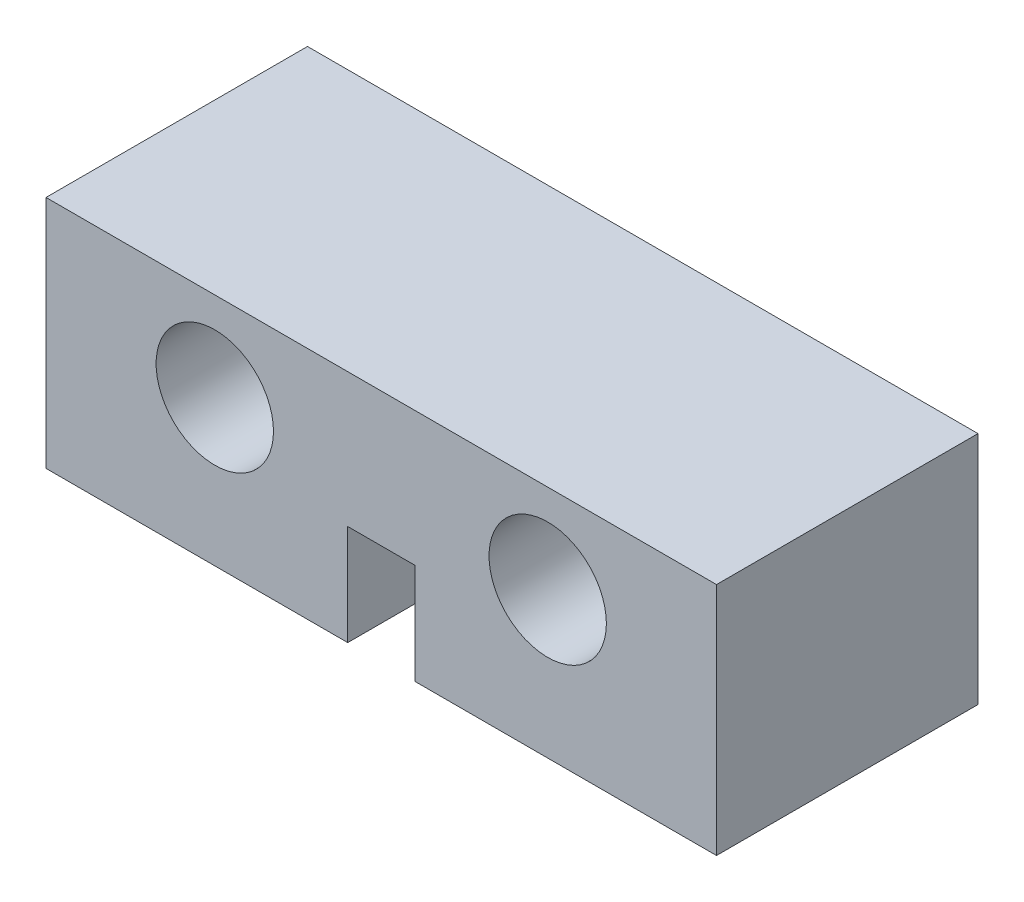
ISO-10303-21;
HEADER;
FILE_DESCRIPTION(('STEP AP214'),'2;1');
FILE_NAME('part.step','',(''),(''),'','','');
FILE_SCHEMA(('AUTOMOTIVE_DESIGN { 1 0 10303 214 1 1 1 1 }'));
ENDSEC;
DATA;
#1=APPLICATION_CONTEXT('core data for automotive mechanical design processes');
#2=APPLICATION_PROTOCOL_DEFINITION('international standard','automotive_design',2000,#1);
#3=PRODUCT_CONTEXT('',#1,'mechanical');
#4=PRODUCT('Part','Part','',(#3));
#5=PRODUCT_RELATED_PRODUCT_CATEGORY('part','',(#4));
#6=PRODUCT_DEFINITION_FORMATION('','',#4);
#7=PRODUCT_DEFINITION_CONTEXT('part definition',#1,'design');
#8=PRODUCT_DEFINITION('design','',#6,#7);
#9=PRODUCT_DEFINITION_SHAPE('','',#8);
#10=(LENGTH_UNIT() NAMED_UNIT(*) SI_UNIT(.MILLI.,.METRE.));
#11=(NAMED_UNIT(*) PLANE_ANGLE_UNIT() SI_UNIT($,.RADIAN.));
#12=(NAMED_UNIT(*) SI_UNIT($,.STERADIAN.) SOLID_ANGLE_UNIT());
#13=UNCERTAINTY_MEASURE_WITH_UNIT(LENGTH_MEASURE(1.E-05),#10,'distance_accuracy_value','');
#14=(GEOMETRIC_REPRESENTATION_CONTEXT(3) GLOBAL_UNCERTAINTY_ASSIGNED_CONTEXT((#13)) GLOBAL_UNIT_ASSIGNED_CONTEXT((#10,
#11,#12)) REPRESENTATION_CONTEXT('',''));
#15=CARTESIAN_POINT('',(0.,0.,0.));
#16=DIRECTION('',(0.,0.,1.));
#17=DIRECTION('',(1.,0.,0.));
#18=AXIS2_PLACEMENT_3D('',#15,#16,#17);
#19=CARTESIAN_POINT('',(-10.,-3.5,7.8));
#20=DIRECTION('',(0.,1.,0.));
#21=DIRECTION('',(0.,0.,1.));
#22=AXIS2_PLACEMENT_3D('',#19,#20,#21);
#23=PLANE('',#22);
#24=DIRECTION('',(1.,0.,0.));
#25=VECTOR('',#24,1.);
#26=CARTESIAN_POINT('',(-10.,-3.5,0.));
#27=LINE('',#26,#25);
#28=CARTESIAN_POINT('',(-10.,-3.5,0.));
#29=VERTEX_POINT('',#28);
#30=CARTESIAN_POINT('',(-1.,-3.5,0.));
#31=VERTEX_POINT('',#30);
#32=EDGE_CURVE('E127',#29,#31,#27,.T.);
#33=ORIENTED_EDGE('',*,*,#32,.T.);
#34=DIRECTION('',(0.,0.,1.));
#35=VECTOR('',#34,1.);
#36=CARTESIAN_POINT('',(-1.,-3.5,0.));
#37=LINE('',#36,#35);
#38=CARTESIAN_POINT('',(-1.,-3.5,7.8));
#39=VERTEX_POINT('',#38);
#40=EDGE_CURVE('E110',#31,#39,#37,.T.);
#41=ORIENTED_EDGE('',*,*,#40,.T.);
#42=DIRECTION('',(1.,0.,0.));
#43=VECTOR('',#42,1.);
#44=CARTESIAN_POINT('',(-10.,-3.5,7.8));
#45=LINE('',#44,#43);
#46=CARTESIAN_POINT('',(-10.,-3.5,7.8));
#47=VERTEX_POINT('',#46);
#48=EDGE_CURVE('E144',#47,#39,#45,.T.);
#49=ORIENTED_EDGE('',*,*,#48,.F.);
#50=DIRECTION('',(0.,0.,-1.));
#51=VECTOR('',#50,1.);
#52=CARTESIAN_POINT('',(-10.,-3.5,7.8));
#53=LINE('',#52,#51);
#54=EDGE_CURVE('E134',#47,#29,#53,.T.);
#55=ORIENTED_EDGE('',*,*,#54,.T.);
#56=EDGE_LOOP('',(#33,#41,#49,#55));
#57=FACE_BOUND('',#56,.T.);
#58=ADVANCED_FACE('F35',(#57),#23,.F.);
#59=CARTESIAN_POINT('',(10.,-3.5,7.8));
#60=DIRECTION('',(-1.,0.,0.));
#61=DIRECTION('',(0.,0.,1.));
#62=AXIS2_PLACEMENT_3D('',#59,#60,#61);
#63=PLANE('',#62);
#64=DIRECTION('',(0.,1.,0.));
#65=VECTOR('',#64,1.);
#66=CARTESIAN_POINT('',(10.,-3.5,0.));
#67=LINE('',#66,#65);
#68=CARTESIAN_POINT('',(10.,-3.5,0.));
#69=VERTEX_POINT('',#68);
#70=CARTESIAN_POINT('',(10.,3.5,0.));
#71=VERTEX_POINT('',#70);
#72=EDGE_CURVE('E152',#69,#71,#67,.T.);
#73=ORIENTED_EDGE('',*,*,#72,.T.);
#74=DIRECTION('',(0.,0.,-1.));
#75=VECTOR('',#74,1.);
#76=CARTESIAN_POINT('',(10.,3.5,7.8));
#77=LINE('',#76,#75);
#78=CARTESIAN_POINT('',(10.,3.5,7.8));
#79=VERTEX_POINT('',#78);
#80=EDGE_CURVE('E11',#79,#71,#77,.T.);
#81=ORIENTED_EDGE('',*,*,#80,.F.);
#82=DIRECTION('',(0.,1.,0.));
#83=VECTOR('',#82,1.);
#84=CARTESIAN_POINT('',(10.,-3.5,7.8));
#85=LINE('',#84,#83);
#86=CARTESIAN_POINT('',(10.,-3.5,7.8));
#87=VERTEX_POINT('',#86);
#88=EDGE_CURVE('E135',#87,#79,#85,.T.);
#89=ORIENTED_EDGE('',*,*,#88,.F.);
#90=DIRECTION('',(0.,0.,-1.));
#91=VECTOR('',#90,1.);
#92=CARTESIAN_POINT('',(10.,-3.5,7.8));
#93=LINE('',#92,#91);
#94=EDGE_CURVE('E142',#87,#69,#93,.T.);
#95=ORIENTED_EDGE('',*,*,#94,.T.);
#96=EDGE_LOOP('',(#73,#81,#89,#95));
#97=FACE_BOUND('',#96,.T.);
#98=ADVANCED_FACE('F37',(#97),#63,.F.);
#99=CARTESIAN_POINT('',(-10.,3.5,7.8));
#100=DIRECTION('',(0.,-1.,0.));
#101=DIRECTION('',(0.,0.,-1.));
#102=AXIS2_PLACEMENT_3D('',#99,#100,#101);
#103=PLANE('',#102);
#104=DIRECTION('',(-1.,0.,0.));
#105=VECTOR('',#104,1.);
#106=CARTESIAN_POINT('',(-10.,3.5,0.));
#107=LINE('',#106,#105);
#108=CARTESIAN_POINT('',(-10.,3.5,0.));
#109=VERTEX_POINT('',#108);
#110=EDGE_CURVE('E151',#71,#109,#107,.T.);
#111=ORIENTED_EDGE('',*,*,#110,.T.);
#112=DIRECTION('',(0.,0.,-1.));
#113=VECTOR('',#112,1.);
#114=CARTESIAN_POINT('',(-10.,3.5,7.8));
#115=LINE('',#114,#113);
#116=CARTESIAN_POINT('',(-10.,3.5,7.8));
#117=VERTEX_POINT('',#116);
#118=EDGE_CURVE('E43',#117,#109,#115,.T.);
#119=ORIENTED_EDGE('',*,*,#118,.F.);
#120=DIRECTION('',(-1.,0.,0.));
#121=VECTOR('',#120,1.);
#122=CARTESIAN_POINT('',(-10.,3.5,7.8));
#123=LINE('',#122,#121);
#124=EDGE_CURVE('E88',#79,#117,#123,.T.);
#125=ORIENTED_EDGE('',*,*,#124,.F.);
#126=ORIENTED_EDGE('',*,*,#80,.T.);
#127=EDGE_LOOP('',(#111,#119,#125,#126));
#128=FACE_BOUND('',#127,.T.);
#129=ADVANCED_FACE('F208',(#128),#103,.F.);
#130=CARTESIAN_POINT('',(-10.,-3.5,7.8));
#131=DIRECTION('',(1.,0.,0.));
#132=DIRECTION('',(0.,0.,-1.));
#133=AXIS2_PLACEMENT_3D('',#130,#131,#132);
#134=PLANE('',#133);
#135=DIRECTION('',(0.,-1.,0.));
#136=VECTOR('',#135,1.);
#137=CARTESIAN_POINT('',(-10.,-3.5,0.));
#138=LINE('',#137,#136);
#139=EDGE_CURVE('E138',#109,#29,#138,.T.);
#140=ORIENTED_EDGE('',*,*,#139,.T.);
#141=ORIENTED_EDGE('',*,*,#54,.F.);
#142=DIRECTION('',(0.,-1.,0.));
#143=VECTOR('',#142,1.);
#144=CARTESIAN_POINT('',(-10.,-3.5,7.8));
#145=LINE('',#144,#143);
#146=EDGE_CURVE('E149',#117,#47,#145,.T.);
#147=ORIENTED_EDGE('',*,*,#146,.F.);
#148=ORIENTED_EDGE('',*,*,#118,.T.);
#149=EDGE_LOOP('',(#140,#141,#147,#148));
#150=FACE_BOUND('',#149,.T.);
#151=ADVANCED_FACE('F148',(#150),#134,.F.);
#152=CARTESIAN_POINT('',(1.,-3.5,7.8));
#153=VERTEX_POINT('',#152);
#154=EDGE_CURVE('E59',#153,#87,#45,.T.);
#155=ORIENTED_EDGE('',*,*,#154,.F.);
#156=DIRECTION('',(0.,0.,1.));
#157=VECTOR('',#156,1.);
#158=CARTESIAN_POINT('',(1.,-3.5,0.));
#159=LINE('',#158,#157);
#160=CARTESIAN_POINT('',(1.,-3.5,0.));
#161=VERTEX_POINT('',#160);
#162=EDGE_CURVE('E120',#161,#153,#159,.T.);
#163=ORIENTED_EDGE('',*,*,#162,.F.);
#164=EDGE_CURVE('E81',#161,#69,#27,.T.);
#165=ORIENTED_EDGE('',*,*,#164,.T.);
#166=ORIENTED_EDGE('',*,*,#94,.F.);
#167=EDGE_LOOP('',(#155,#163,#165,#166));
#168=FACE_BOUND('',#167,.T.);
#169=ADVANCED_FACE('F185',(#168),#23,.F.);
#170=CARTESIAN_POINT('',(0.,0.,7.8));
#171=DIRECTION('',(0.,0.,-1.));
#172=DIRECTION('',(-1.,0.,0.));
#173=AXIS2_PLACEMENT_3D('',#170,#171,#172);
#174=PLANE('',#173);
#175=CARTESIAN_POINT('',(-4.965,0.849999999999999,7.8));
#176=DIRECTION('',(0.,0.,1.));
#177=DIRECTION('',(1.,0.,0.));
#178=AXIS2_PLACEMENT_3D('',#175,#176,#177);
#179=CIRCLE('',#178,1.75);
#180=CARTESIAN_POINT('',(-3.215,0.849999999999999,7.8));
#181=VERTEX_POINT('',#180);
#182=EDGE_CURVE('E167',#181,#181,#179,.T.);
#183=ORIENTED_EDGE('',*,*,#182,.F.);
#184=EDGE_LOOP('',(#183));
#185=FACE_BOUND('',#184,.T.);
#186=CARTESIAN_POINT('',(4.965,0.849999999999999,7.8));
#187=DIRECTION('',(0.,0.,1.));
#188=DIRECTION('',(1.,0.,0.));
#189=AXIS2_PLACEMENT_3D('',#186,#187,#188);
#190=CIRCLE('',#189,1.75);
#191=CARTESIAN_POINT('',(6.715,0.849999999999999,7.8));
#192=VERTEX_POINT('',#191);
#193=EDGE_CURVE('E160',#192,#192,#190,.T.);
#194=ORIENTED_EDGE('',*,*,#193,.F.);
#195=EDGE_LOOP('',(#194));
#196=FACE_BOUND('',#195,.T.);
#197=ORIENTED_EDGE('',*,*,#48,.T.);
#198=DIRECTION('',(0.,-1.,0.));
#199=VECTOR('',#198,1.);
#200=CARTESIAN_POINT('',(-1.,-3.5,7.8));
#201=LINE('',#200,#199);
#202=CARTESIAN_POINT('',(-0.999999999999999,-0.500000000000002,7.8));
#203=VERTEX_POINT('',#202);
#204=EDGE_CURVE('E115',#203,#39,#201,.T.);
#205=ORIENTED_EDGE('',*,*,#204,.F.);
#206=DIRECTION('',(-1.,0.,0.));
#207=VECTOR('',#206,1.);
#208=CARTESIAN_POINT('',(-0.999999999999999,-0.500000000000002,7.8));
#209=LINE('',#208,#207);
#210=CARTESIAN_POINT('',(1.,-0.500000000000001,7.8));
#211=VERTEX_POINT('',#210);
#212=EDGE_CURVE('E130',#211,#203,#209,.T.);
#213=ORIENTED_EDGE('',*,*,#212,.F.);
#214=DIRECTION('',(0.,1.,0.));
#215=VECTOR('',#214,1.);
#216=CARTESIAN_POINT('',(1.,-3.5,7.8));
#217=LINE('',#216,#215);
#218=EDGE_CURVE('E178',#153,#211,#217,.T.);
#219=ORIENTED_EDGE('',*,*,#218,.F.);
#220=ORIENTED_EDGE('',*,*,#154,.T.);
#221=ORIENTED_EDGE('',*,*,#88,.T.);
#222=ORIENTED_EDGE('',*,*,#124,.T.);
#223=ORIENTED_EDGE('',*,*,#146,.T.);
#224=EDGE_LOOP('',(#197,#205,#213,#219,#220,#221,#222,#223));
#225=FACE_BOUND('',#224,.T.);
#226=ADVANCED_FACE('F189',(#185,#196,#225),#174,.F.);
#227=CARTESIAN_POINT('',(0.,0.,0.));
#228=DIRECTION('',(0.,0.,-1.));
#229=DIRECTION('',(-1.,0.,0.));
#230=AXIS2_PLACEMENT_3D('',#227,#228,#229);
#231=PLANE('',#230);
#232=DIRECTION('',(0.,-1.,0.));
#233=VECTOR('',#232,1.);
#234=CARTESIAN_POINT('',(-1.,-3.5,0.));
#235=LINE('',#234,#233);
#236=CARTESIAN_POINT('',(-0.999999999999999,-0.500000000000002,0.));
#237=VERTEX_POINT('',#236);
#238=EDGE_CURVE('E113',#237,#31,#235,.T.);
#239=ORIENTED_EDGE('',*,*,#238,.T.);
#240=ORIENTED_EDGE('',*,*,#32,.F.);
#241=ORIENTED_EDGE('',*,*,#139,.F.);
#242=ORIENTED_EDGE('',*,*,#110,.F.);
#243=ORIENTED_EDGE('',*,*,#72,.F.);
#244=ORIENTED_EDGE('',*,*,#164,.F.);
#245=DIRECTION('',(0.,1.,0.));
#246=VECTOR('',#245,1.);
#247=CARTESIAN_POINT('',(1.,-3.5,0.));
#248=LINE('',#247,#246);
#249=CARTESIAN_POINT('',(1.,-0.500000000000001,0.));
#250=VERTEX_POINT('',#249);
#251=EDGE_CURVE('E129',#161,#250,#248,.T.);
#252=ORIENTED_EDGE('',*,*,#251,.T.);
#253=DIRECTION('',(-1.,0.,0.));
#254=VECTOR('',#253,1.);
#255=CARTESIAN_POINT('',(-0.999999999999999,-0.500000000000002,0.));
#256=LINE('',#255,#254);
#257=EDGE_CURVE('E50',#250,#237,#256,.T.);
#258=ORIENTED_EDGE('',*,*,#257,.T.);
#259=EDGE_LOOP('',(#239,#240,#241,#242,#243,#244,#252,#258));
#260=FACE_BOUND('',#259,.T.);
#261=CARTESIAN_POINT('',(-4.965,0.849999999999999,0.));
#262=DIRECTION('',(0.,0.,1.));
#263=DIRECTION('',(1.,0.,0.));
#264=AXIS2_PLACEMENT_3D('',#261,#262,#263);
#265=CIRCLE('',#264,1.75);
#266=CARTESIAN_POINT('',(-3.215,0.849999999999999,0.));
#267=VERTEX_POINT('',#266);
#268=EDGE_CURVE('E154',#267,#267,#265,.T.);
#269=ORIENTED_EDGE('',*,*,#268,.T.);
#270=EDGE_LOOP('',(#269));
#271=FACE_BOUND('',#270,.T.);
#272=CARTESIAN_POINT('',(4.965,0.849999999999999,0.));
#273=DIRECTION('',(0.,0.,1.));
#274=DIRECTION('',(1.,0.,0.));
#275=AXIS2_PLACEMENT_3D('',#272,#273,#274);
#276=CIRCLE('',#275,1.75);
#277=CARTESIAN_POINT('',(6.715,0.849999999999999,0.));
#278=VERTEX_POINT('',#277);
#279=EDGE_CURVE('E163',#278,#278,#276,.T.);
#280=ORIENTED_EDGE('',*,*,#279,.T.);
#281=EDGE_LOOP('',(#280));
#282=FACE_BOUND('',#281,.T.);
#283=ADVANCED_FACE('F124',(#260,#271,#282),#231,.T.);
#284=CARTESIAN_POINT('',(4.965,0.849999999999999,0.));
#285=DIRECTION('',(0.,0.,1.));
#286=DIRECTION('',(1.,0.,0.));
#287=AXIS2_PLACEMENT_3D('',#284,#285,#286);
#288=CYLINDRICAL_SURFACE('',#287,1.75);
#289=ORIENTED_EDGE('',*,*,#279,.F.);
#290=EDGE_LOOP('',(#289));
#291=FACE_BOUND('',#290,.T.);
#292=ORIENTED_EDGE('',*,*,#193,.T.);
#293=EDGE_LOOP('',(#292));
#294=FACE_BOUND('',#293,.T.);
#295=ADVANCED_FACE('F252',(#291,#294),#288,.F.);
#296=CARTESIAN_POINT('',(-4.965,0.849999999999999,0.));
#297=DIRECTION('',(0.,0.,1.));
#298=DIRECTION('',(1.,0.,0.));
#299=AXIS2_PLACEMENT_3D('',#296,#297,#298);
#300=CYLINDRICAL_SURFACE('',#299,1.75);
#301=ORIENTED_EDGE('',*,*,#268,.F.);
#302=EDGE_LOOP('',(#301));
#303=FACE_BOUND('',#302,.T.);
#304=ORIENTED_EDGE('',*,*,#182,.T.);
#305=EDGE_LOOP('',(#304));
#306=FACE_BOUND('',#305,.T.);
#307=ADVANCED_FACE('F199',(#303,#306),#300,.F.);
#308=CARTESIAN_POINT('',(-1.,-3.5,0.));
#309=DIRECTION('',(-1.,0.,0.));
#310=DIRECTION('',(0.,-1.,0.));
#311=AXIS2_PLACEMENT_3D('',#308,#309,#310);
#312=PLANE('',#311);
#313=ORIENTED_EDGE('',*,*,#204,.T.);
#314=ORIENTED_EDGE('',*,*,#40,.F.);
#315=ORIENTED_EDGE('',*,*,#238,.F.);
#316=DIRECTION('',(0.,0.,1.));
#317=VECTOR('',#316,1.);
#318=CARTESIAN_POINT('',(-0.999999999999999,-0.500000000000002,0.));
#319=LINE('',#318,#317);
#320=EDGE_CURVE('E164',#237,#203,#319,.T.);
#321=ORIENTED_EDGE('',*,*,#320,.T.);
#322=EDGE_LOOP('',(#313,#314,#315,#321));
#323=FACE_BOUND('',#322,.T.);
#324=ADVANCED_FACE('F112',(#323),#312,.F.);
#325=CARTESIAN_POINT('',(-0.999999999999999,-0.500000000000002,0.));
#326=DIRECTION('',(0.,1.,0.));
#327=DIRECTION('',(-1.,0.,0.));
#328=AXIS2_PLACEMENT_3D('',#325,#326,#327);
#329=PLANE('',#328);
#330=ORIENTED_EDGE('',*,*,#212,.T.);
#331=ORIENTED_EDGE('',*,*,#320,.F.);
#332=ORIENTED_EDGE('',*,*,#257,.F.);
#333=DIRECTION('',(0.,0.,1.));
#334=VECTOR('',#333,1.);
#335=CARTESIAN_POINT('',(1.,-0.500000000000001,0.));
#336=LINE('',#335,#334);
#337=EDGE_CURVE('E173',#250,#211,#336,.T.);
#338=ORIENTED_EDGE('',*,*,#337,.T.);
#339=EDGE_LOOP('',(#330,#331,#332,#338));
#340=FACE_BOUND('',#339,.T.);
#341=ADVANCED_FACE('F191',(#340),#329,.F.);
#342=CARTESIAN_POINT('',(1.,-3.5,0.));
#343=DIRECTION('',(1.,0.,0.));
#344=DIRECTION('',(0.,1.,0.));
#345=AXIS2_PLACEMENT_3D('',#342,#343,#344);
#346=PLANE('',#345);
#347=ORIENTED_EDGE('',*,*,#218,.T.);
#348=ORIENTED_EDGE('',*,*,#337,.F.);
#349=ORIENTED_EDGE('',*,*,#251,.F.);
#350=ORIENTED_EDGE('',*,*,#162,.T.);
#351=EDGE_LOOP('',(#347,#348,#349,#350));
#352=FACE_BOUND('',#351,.T.);
#353=ADVANCED_FACE('F184',(#352),#346,.F.);
#354=CLOSED_SHELL('',(#58,#98,#129,#151,#169,#226,#283,#295,#307,#324,#341,#353));
#355=MANIFOLD_SOLID_BREP('B2',#354);
#356=ADVANCED_BREP_SHAPE_REPRESENTATION('',(#18,#355),#14);
#357=SHAPE_DEFINITION_REPRESENTATION(#9,#356);
ENDSEC;
END-ISO-10303-21;
